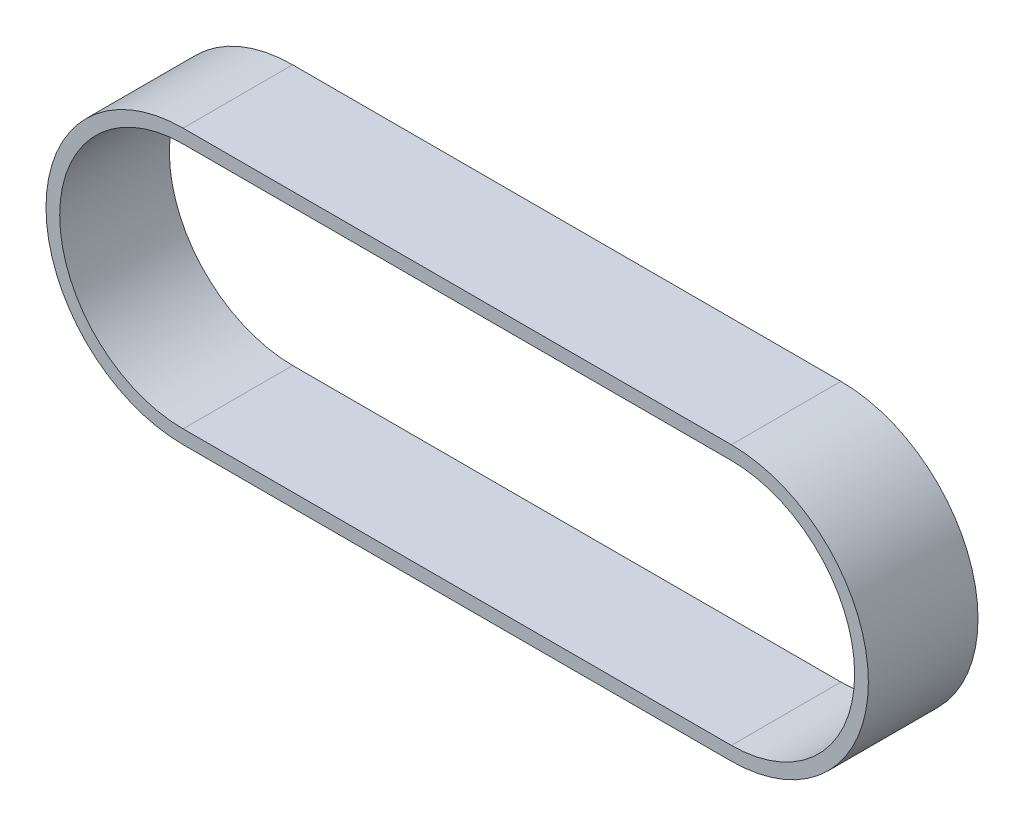
ISO-10303-21;
HEADER;
FILE_DESCRIPTION(('STEP AP214'),'2;1');
FILE_NAME('part.step','',(''),(''),'','','');
FILE_SCHEMA(('AUTOMOTIVE_DESIGN { 1 0 10303 214 1 1 1 1 }'));
ENDSEC;
DATA;
#1=APPLICATION_CONTEXT('core data for automotive mechanical design processes');
#2=APPLICATION_PROTOCOL_DEFINITION('international standard','automotive_design',2000,#1);
#3=PRODUCT_CONTEXT('',#1,'mechanical');
#4=PRODUCT('Part','Part','',(#3));
#5=PRODUCT_RELATED_PRODUCT_CATEGORY('part','',(#4));
#6=PRODUCT_DEFINITION_FORMATION('','',#4);
#7=PRODUCT_DEFINITION_CONTEXT('part definition',#1,'design');
#8=PRODUCT_DEFINITION('design','',#6,#7);
#9=PRODUCT_DEFINITION_SHAPE('','',#8);
#10=(LENGTH_UNIT() NAMED_UNIT(*) SI_UNIT(.MILLI.,.METRE.));
#11=(NAMED_UNIT(*) PLANE_ANGLE_UNIT() SI_UNIT($,.RADIAN.));
#12=(NAMED_UNIT(*) SI_UNIT($,.STERADIAN.) SOLID_ANGLE_UNIT());
#13=UNCERTAINTY_MEASURE_WITH_UNIT(LENGTH_MEASURE(1.E-05),#10,'distance_accuracy_value','');
#14=(GEOMETRIC_REPRESENTATION_CONTEXT(3) GLOBAL_UNCERTAINTY_ASSIGNED_CONTEXT((#13)) GLOBAL_UNIT_ASSIGNED_CONTEXT((#10,
#11,#12)) REPRESENTATION_CONTEXT('',''));
#15=CARTESIAN_POINT('',(0.,0.,0.));
#16=DIRECTION('',(0.,0.,1.));
#17=DIRECTION('',(1.,0.,0.));
#18=AXIS2_PLACEMENT_3D('',#15,#16,#17);
#19=CARTESIAN_POINT('',(-50.,0.,20.));
#20=DIRECTION('',(0.,0.,1.));
#21=DIRECTION('',(1.,0.,0.));
#22=AXIS2_PLACEMENT_3D('',#19,#20,#21);
#23=PLANE('',#22);
#24=CARTESIAN_POINT('',(-50.,0.,20.));
#25=DIRECTION('',(0.,0.,1.));
#26=DIRECTION('',(1.,0.,0.));
#27=AXIS2_PLACEMENT_3D('',#24,#25,#26);
#28=CIRCLE('',#27,25.);
#29=CARTESIAN_POINT('',(-50.,25.,20.));
#30=VERTEX_POINT('',#29);
#31=CARTESIAN_POINT('',(-50.,-25.,20.));
#32=VERTEX_POINT('',#31);
#33=EDGE_CURVE('E134',#30,#32,#28,.T.);
#34=ORIENTED_EDGE('',*,*,#33,.T.);
#35=DIRECTION('',(1.,0.,0.));
#36=VECTOR('',#35,1.);
#37=CARTESIAN_POINT('',(50.,-25.,20.));
#38=LINE('',#37,#36);
#39=CARTESIAN_POINT('',(50.,-25.,20.));
#40=VERTEX_POINT('',#39);
#41=EDGE_CURVE('E137',#32,#40,#38,.T.);
#42=ORIENTED_EDGE('',*,*,#41,.T.);
#43=CARTESIAN_POINT('',(50.,0.,20.));
#44=DIRECTION('',(0.,0.,1.));
#45=DIRECTION('',(1.,0.,0.));
#46=AXIS2_PLACEMENT_3D('',#43,#44,#45);
#47=CIRCLE('',#46,25.);
#48=CARTESIAN_POINT('',(50.,25.,20.));
#49=VERTEX_POINT('',#48);
#50=EDGE_CURVE('E140',#40,#49,#47,.T.);
#51=ORIENTED_EDGE('',*,*,#50,.T.);
#52=DIRECTION('',(-1.,0.,0.));
#53=VECTOR('',#52,1.);
#54=CARTESIAN_POINT('',(-50.,25.,20.));
#55=LINE('',#54,#53);
#56=EDGE_CURVE('E142',#49,#30,#55,.T.);
#57=ORIENTED_EDGE('',*,*,#56,.T.);
#58=EDGE_LOOP('',(#34,#42,#51,#57));
#59=FACE_BOUND('',#58,.T.);
#60=DIRECTION('',(1.,0.,0.));
#61=VECTOR('',#60,1.);
#62=CARTESIAN_POINT('',(50.,-22.5,20.));
#63=LINE('',#62,#61);
#64=CARTESIAN_POINT('',(-50.,-22.5,20.));
#65=VERTEX_POINT('',#64);
#66=CARTESIAN_POINT('',(50.,-22.5,20.));
#67=VERTEX_POINT('',#66);
#68=EDGE_CURVE('E106',#65,#67,#63,.T.);
#69=ORIENTED_EDGE('',*,*,#68,.F.);
#70=CARTESIAN_POINT('',(-50.,0.,20.));
#71=DIRECTION('',(0.,0.,1.));
#72=DIRECTION('',(1.,0.,0.));
#73=AXIS2_PLACEMENT_3D('',#70,#71,#72);
#74=CIRCLE('',#73,22.5);
#75=CARTESIAN_POINT('',(-50.,22.5,20.));
#76=VERTEX_POINT('',#75);
#77=EDGE_CURVE('E98',#76,#65,#74,.T.);
#78=ORIENTED_EDGE('',*,*,#77,.F.);
#79=DIRECTION('',(-1.,0.,0.));
#80=VECTOR('',#79,1.);
#81=CARTESIAN_POINT('',(-50.,22.5,20.));
#82=LINE('',#81,#80);
#83=CARTESIAN_POINT('',(50.,22.5,20.));
#84=VERTEX_POINT('',#83);
#85=EDGE_CURVE('E120',#84,#76,#82,.T.);
#86=ORIENTED_EDGE('',*,*,#85,.F.);
#87=CARTESIAN_POINT('',(50.,0.,20.));
#88=DIRECTION('',(0.,0.,1.));
#89=DIRECTION('',(1.,0.,0.));
#90=AXIS2_PLACEMENT_3D('',#87,#88,#89);
#91=CIRCLE('',#90,22.5);
#92=EDGE_CURVE('E118',#67,#84,#91,.T.);
#93=ORIENTED_EDGE('',*,*,#92,.F.);
#94=EDGE_LOOP('',(#69,#78,#86,#93));
#95=FACE_BOUND('',#94,.T.);
#96=ADVANCED_FACE('F33',(#59,#95),#23,.T.);
#97=CARTESIAN_POINT('',(-50.,0.,0.));
#98=DIRECTION('',(0.,0.,1.));
#99=DIRECTION('',(1.,0.,0.));
#100=AXIS2_PLACEMENT_3D('',#97,#98,#99);
#101=PLANE('',#100);
#102=CARTESIAN_POINT('',(-50.,0.,0.));
#103=DIRECTION('',(0.,0.,1.));
#104=DIRECTION('',(1.,0.,0.));
#105=AXIS2_PLACEMENT_3D('',#102,#103,#104);
#106=CIRCLE('',#105,25.);
#107=CARTESIAN_POINT('',(-50.,25.,0.));
#108=VERTEX_POINT('',#107);
#109=CARTESIAN_POINT('',(-50.,-25.,0.));
#110=VERTEX_POINT('',#109);
#111=EDGE_CURVE('E114',#108,#110,#106,.T.);
#112=ORIENTED_EDGE('',*,*,#111,.F.);
#113=DIRECTION('',(-1.,0.,0.));
#114=VECTOR('',#113,1.);
#115=CARTESIAN_POINT('',(-50.,25.,0.));
#116=LINE('',#115,#114);
#117=CARTESIAN_POINT('',(50.,25.,0.));
#118=VERTEX_POINT('',#117);
#119=EDGE_CURVE('E138',#118,#108,#116,.T.);
#120=ORIENTED_EDGE('',*,*,#119,.F.);
#121=CARTESIAN_POINT('',(50.,0.,0.));
#122=DIRECTION('',(0.,0.,1.));
#123=DIRECTION('',(1.,0.,0.));
#124=AXIS2_PLACEMENT_3D('',#121,#122,#123);
#125=CIRCLE('',#124,25.);
#126=CARTESIAN_POINT('',(50.,-25.,0.));
#127=VERTEX_POINT('',#126);
#128=EDGE_CURVE('E149',#127,#118,#125,.T.);
#129=ORIENTED_EDGE('',*,*,#128,.F.);
#130=DIRECTION('',(1.,0.,0.));
#131=VECTOR('',#130,1.);
#132=CARTESIAN_POINT('',(50.,-25.,0.));
#133=LINE('',#132,#131);
#134=EDGE_CURVE('E147',#110,#127,#133,.T.);
#135=ORIENTED_EDGE('',*,*,#134,.F.);
#136=EDGE_LOOP('',(#112,#120,#129,#135));
#137=FACE_BOUND('',#136,.T.);
#138=CARTESIAN_POINT('',(-50.,0.,0.));
#139=DIRECTION('',(0.,0.,1.));
#140=DIRECTION('',(1.,0.,0.));
#141=AXIS2_PLACEMENT_3D('',#138,#139,#140);
#142=CIRCLE('',#141,22.5);
#143=CARTESIAN_POINT('',(-50.,22.5,0.));
#144=VERTEX_POINT('',#143);
#145=CARTESIAN_POINT('',(-50.,-22.5,0.));
#146=VERTEX_POINT('',#145);
#147=EDGE_CURVE('E56',#144,#146,#142,.T.);
#148=ORIENTED_EDGE('',*,*,#147,.T.);
#149=DIRECTION('',(1.,0.,0.));
#150=VECTOR('',#149,1.);
#151=CARTESIAN_POINT('',(50.,-22.5,0.));
#152=LINE('',#151,#150);
#153=CARTESIAN_POINT('',(50.,-22.5,0.));
#154=VERTEX_POINT('',#153);
#155=EDGE_CURVE('E113',#146,#154,#152,.T.);
#156=ORIENTED_EDGE('',*,*,#155,.T.);
#157=CARTESIAN_POINT('',(50.,0.,0.));
#158=DIRECTION('',(0.,0.,1.));
#159=DIRECTION('',(1.,0.,0.));
#160=AXIS2_PLACEMENT_3D('',#157,#158,#159);
#161=CIRCLE('',#160,22.5);
#162=CARTESIAN_POINT('',(50.,22.5,0.));
#163=VERTEX_POINT('',#162);
#164=EDGE_CURVE('E126',#154,#163,#161,.T.);
#165=ORIENTED_EDGE('',*,*,#164,.T.);
#166=DIRECTION('',(-1.,0.,0.));
#167=VECTOR('',#166,1.);
#168=CARTESIAN_POINT('',(-50.,22.5,0.));
#169=LINE('',#168,#167);
#170=EDGE_CURVE('E107',#163,#144,#169,.T.);
#171=ORIENTED_EDGE('',*,*,#170,.T.);
#172=EDGE_LOOP('',(#148,#156,#165,#171));
#173=FACE_BOUND('',#172,.T.);
#174=ADVANCED_FACE('F167',(#137,#173),#101,.F.);
#175=CARTESIAN_POINT('',(-50.,0.,20.));
#176=DIRECTION('',(0.,0.,-1.));
#177=DIRECTION('',(-1.,0.,0.));
#178=AXIS2_PLACEMENT_3D('',#175,#176,#177);
#179=CYLINDRICAL_SURFACE('',#178,25.);
#180=ORIENTED_EDGE('',*,*,#111,.T.);
#181=DIRECTION('',(0.,0.,-1.));
#182=VECTOR('',#181,1.);
#183=CARTESIAN_POINT('',(-50.,-25.,20.));
#184=LINE('',#183,#182);
#185=EDGE_CURVE('E11',#32,#110,#184,.T.);
#186=ORIENTED_EDGE('',*,*,#185,.F.);
#187=ORIENTED_EDGE('',*,*,#33,.F.);
#188=DIRECTION('',(0.,0.,-1.));
#189=VECTOR('',#188,1.);
#190=CARTESIAN_POINT('',(-50.,25.,20.));
#191=LINE('',#190,#189);
#192=EDGE_CURVE('E144',#30,#108,#191,.T.);
#193=ORIENTED_EDGE('',*,*,#192,.T.);
#194=EDGE_LOOP('',(#180,#186,#187,#193));
#195=FACE_BOUND('',#194,.T.);
#196=ADVANCED_FACE('F35',(#195),#179,.T.);
#197=CARTESIAN_POINT('',(50.,-25.,20.));
#198=DIRECTION('',(0.,1.,0.));
#199=DIRECTION('',(-1.,0.,0.));
#200=AXIS2_PLACEMENT_3D('',#197,#198,#199);
#201=PLANE('',#200);
#202=ORIENTED_EDGE('',*,*,#134,.T.);
#203=DIRECTION('',(0.,0.,-1.));
#204=VECTOR('',#203,1.);
#205=CARTESIAN_POINT('',(50.,-25.,20.));
#206=LINE('',#205,#204);
#207=EDGE_CURVE('E41',#40,#127,#206,.T.);
#208=ORIENTED_EDGE('',*,*,#207,.F.);
#209=ORIENTED_EDGE('',*,*,#41,.F.);
#210=ORIENTED_EDGE('',*,*,#185,.T.);
#211=EDGE_LOOP('',(#202,#208,#209,#210));
#212=FACE_BOUND('',#211,.T.);
#213=ADVANCED_FACE('F177',(#212),#201,.F.);
#214=CARTESIAN_POINT('',(50.,0.,20.));
#215=DIRECTION('',(0.,0.,-1.));
#216=DIRECTION('',(-1.,0.,0.));
#217=AXIS2_PLACEMENT_3D('',#214,#215,#216);
#218=CYLINDRICAL_SURFACE('',#217,25.);
#219=ORIENTED_EDGE('',*,*,#128,.T.);
#220=DIRECTION('',(0.,0.,-1.));
#221=VECTOR('',#220,1.);
#222=CARTESIAN_POINT('',(50.,25.,20.));
#223=LINE('',#222,#221);
#224=EDGE_CURVE('E154',#49,#118,#223,.T.);
#225=ORIENTED_EDGE('',*,*,#224,.F.);
#226=ORIENTED_EDGE('',*,*,#50,.F.);
#227=ORIENTED_EDGE('',*,*,#207,.T.);
#228=EDGE_LOOP('',(#219,#225,#226,#227));
#229=FACE_BOUND('',#228,.T.);
#230=ADVANCED_FACE('F161',(#229),#218,.T.);
#231=CARTESIAN_POINT('',(-50.,25.,20.));
#232=DIRECTION('',(0.,-1.,0.));
#233=DIRECTION('',(1.,0.,0.));
#234=AXIS2_PLACEMENT_3D('',#231,#232,#233);
#235=PLANE('',#234);
#236=ORIENTED_EDGE('',*,*,#119,.T.);
#237=ORIENTED_EDGE('',*,*,#192,.F.);
#238=ORIENTED_EDGE('',*,*,#56,.F.);
#239=ORIENTED_EDGE('',*,*,#224,.T.);
#240=EDGE_LOOP('',(#236,#237,#238,#239));
#241=FACE_BOUND('',#240,.T.);
#242=ADVANCED_FACE('F171',(#241),#235,.F.);
#243=CARTESIAN_POINT('',(-50.,0.,20.));
#244=DIRECTION('',(0.,0.,-1.));
#245=DIRECTION('',(-1.,0.,0.));
#246=AXIS2_PLACEMENT_3D('',#243,#244,#245);
#247=CYLINDRICAL_SURFACE('',#246,22.5);
#248=ORIENTED_EDGE('',*,*,#147,.F.);
#249=DIRECTION('',(0.,0.,-1.));
#250=VECTOR('',#249,1.);
#251=CARTESIAN_POINT('',(-50.,22.5,20.));
#252=LINE('',#251,#250);
#253=EDGE_CURVE('E102',#76,#144,#252,.T.);
#254=ORIENTED_EDGE('',*,*,#253,.F.);
#255=ORIENTED_EDGE('',*,*,#77,.T.);
#256=DIRECTION('',(0.,0.,-1.));
#257=VECTOR('',#256,1.);
#258=CARTESIAN_POINT('',(-50.,-22.5,20.));
#259=LINE('',#258,#257);
#260=EDGE_CURVE('E101',#65,#146,#259,.T.);
#261=ORIENTED_EDGE('',*,*,#260,.T.);
#262=EDGE_LOOP('',(#248,#254,#255,#261));
#263=FACE_BOUND('',#262,.T.);
#264=ADVANCED_FACE('F100',(#263),#247,.F.);
#265=CARTESIAN_POINT('',(50.,-22.5,20.));
#266=DIRECTION('',(0.,1.,0.));
#267=DIRECTION('',(-1.,0.,0.));
#268=AXIS2_PLACEMENT_3D('',#265,#266,#267);
#269=PLANE('',#268);
#270=ORIENTED_EDGE('',*,*,#155,.F.);
#271=ORIENTED_EDGE('',*,*,#260,.F.);
#272=ORIENTED_EDGE('',*,*,#68,.T.);
#273=DIRECTION('',(0.,0.,-1.));
#274=VECTOR('',#273,1.);
#275=CARTESIAN_POINT('',(50.,-22.5,20.));
#276=LINE('',#275,#274);
#277=EDGE_CURVE('E115',#67,#154,#276,.T.);
#278=ORIENTED_EDGE('',*,*,#277,.T.);
#279=EDGE_LOOP('',(#270,#271,#272,#278));
#280=FACE_BOUND('',#279,.T.);
#281=ADVANCED_FACE('F110',(#280),#269,.T.);
#282=CARTESIAN_POINT('',(50.,0.,20.));
#283=DIRECTION('',(0.,0.,-1.));
#284=DIRECTION('',(-1.,0.,0.));
#285=AXIS2_PLACEMENT_3D('',#282,#283,#284);
#286=CYLINDRICAL_SURFACE('',#285,22.5);
#287=ORIENTED_EDGE('',*,*,#164,.F.);
#288=ORIENTED_EDGE('',*,*,#277,.F.);
#289=ORIENTED_EDGE('',*,*,#92,.T.);
#290=DIRECTION('',(0.,0.,-1.));
#291=VECTOR('',#290,1.);
#292=CARTESIAN_POINT('',(50.,22.5,20.));
#293=LINE('',#292,#291);
#294=EDGE_CURVE('E48',#84,#163,#293,.T.);
#295=ORIENTED_EDGE('',*,*,#294,.T.);
#296=EDGE_LOOP('',(#287,#288,#289,#295));
#297=FACE_BOUND('',#296,.T.);
#298=ADVANCED_FACE('F200',(#297),#286,.F.);
#299=CARTESIAN_POINT('',(-50.,22.5,20.));
#300=DIRECTION('',(0.,-1.,0.));
#301=DIRECTION('',(1.,0.,0.));
#302=AXIS2_PLACEMENT_3D('',#299,#300,#301);
#303=PLANE('',#302);
#304=ORIENTED_EDGE('',*,*,#170,.F.);
#305=ORIENTED_EDGE('',*,*,#294,.F.);
#306=ORIENTED_EDGE('',*,*,#85,.T.);
#307=ORIENTED_EDGE('',*,*,#253,.T.);
#308=EDGE_LOOP('',(#304,#305,#306,#307));
#309=FACE_BOUND('',#308,.T.);
#310=ADVANCED_FACE('F204',(#309),#303,.T.);
#311=CLOSED_SHELL('',(#96,#174,#196,#213,#230,#242,#264,#281,#298,#310));
#312=MANIFOLD_SOLID_BREP('B2',#311);
#313=ADVANCED_BREP_SHAPE_REPRESENTATION('',(#18,#312),#14);
#314=SHAPE_DEFINITION_REPRESENTATION(#9,#313);
ENDSEC;
END-ISO-10303-21;
